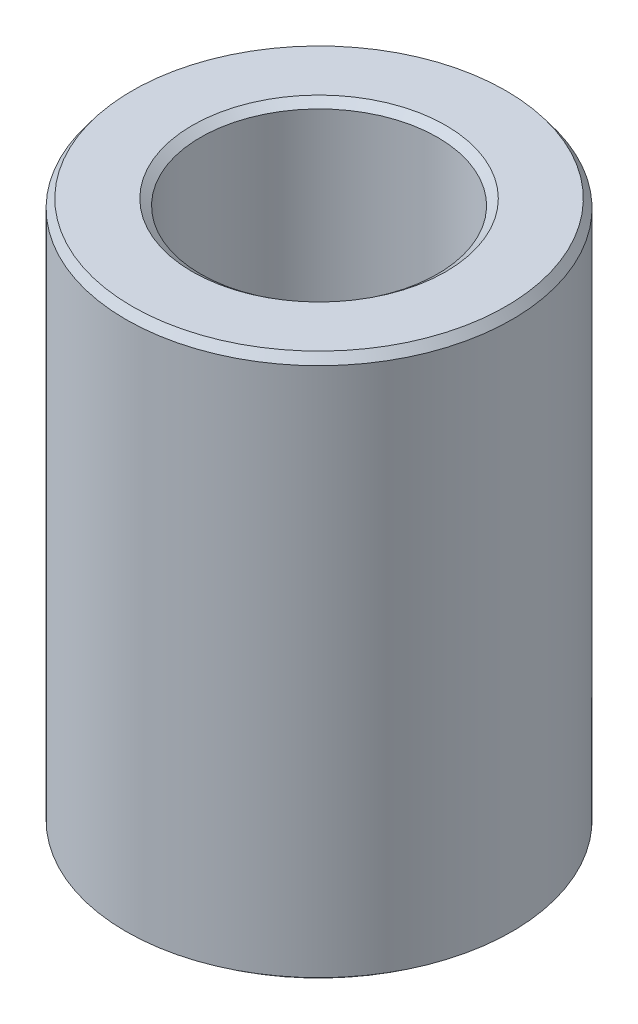
ISO-10303-21;
HEADER;
FILE_DESCRIPTION(('STEP AP214'),'2;1');
FILE_NAME('part.step','',(''),(''),'','','');
FILE_SCHEMA(('AUTOMOTIVE_DESIGN { 1 0 10303 214 1 1 1 1 }'));
ENDSEC;
DATA;
#1=APPLICATION_CONTEXT('core data for automotive mechanical design processes');
#2=APPLICATION_PROTOCOL_DEFINITION('international standard','automotive_design',2000,#1);
#3=PRODUCT_CONTEXT('',#1,'mechanical');
#4=PRODUCT('Part','Part','',(#3));
#5=PRODUCT_RELATED_PRODUCT_CATEGORY('part','',(#4));
#6=PRODUCT_DEFINITION_FORMATION('','',#4);
#7=PRODUCT_DEFINITION_CONTEXT('part definition',#1,'design');
#8=PRODUCT_DEFINITION('design','',#6,#7);
#9=PRODUCT_DEFINITION_SHAPE('','',#8);
#10=(LENGTH_UNIT() NAMED_UNIT(*) SI_UNIT(.MILLI.,.METRE.));
#11=(NAMED_UNIT(*) PLANE_ANGLE_UNIT() SI_UNIT($,.RADIAN.));
#12=(NAMED_UNIT(*) SI_UNIT($,.STERADIAN.) SOLID_ANGLE_UNIT());
#13=UNCERTAINTY_MEASURE_WITH_UNIT(LENGTH_MEASURE(1.E-05),#10,'distance_accuracy_value','');
#14=(GEOMETRIC_REPRESENTATION_CONTEXT(3) GLOBAL_UNCERTAINTY_ASSIGNED_CONTEXT((#13)) GLOBAL_UNIT_ASSIGNED_CONTEXT((#10,
#11,#12)) REPRESENTATION_CONTEXT('',''));
#15=CARTESIAN_POINT('',(0.,0.,0.));
#16=DIRECTION('',(0.,0.,1.));
#17=DIRECTION('',(1.,0.,0.));
#18=AXIS2_PLACEMENT_3D('',#15,#16,#17);
#19=CARTESIAN_POINT('',(0.,56.4109215033235,0.));
#20=DIRECTION('',(0.,-1.,0.));
#21=DIRECTION('',(0.,0.,-1.));
#22=AXIS2_PLACEMENT_3D('',#19,#20,#21);
#23=CYLINDRICAL_SURFACE('',#22,20.);
#24=CARTESIAN_POINT('',(0.,0.638685781611595,0.));
#25=DIRECTION('',(0.,1.,0.));
#26=DIRECTION('',(0.,0.,1.));
#27=AXIS2_PLACEMENT_3D('',#24,#25,#26);
#28=CIRCLE('',#27,20.);
#29=CARTESIAN_POINT('',(0.,0.638685781611595,20.));
#30=VERTEX_POINT('',#29);
#31=EDGE_CURVE('E10',#30,#30,#28,.T.);
#32=ORIENTED_EDGE('',*,*,#31,.T.);
#33=EDGE_LOOP('',(#32));
#34=FACE_BOUND('',#33,.T.);
#35=CARTESIAN_POINT('',(0.,55.5521593152775,0.));
#36=DIRECTION('',(0.,1.,0.));
#37=DIRECTION('',(0.,0.,1.));
#38=AXIS2_PLACEMENT_3D('',#35,#36,#37);
#39=CIRCLE('',#38,20.);
#40=CARTESIAN_POINT('',(0.,55.5521593152775,20.));
#41=VERTEX_POINT('',#40);
#42=EDGE_CURVE('E50',#41,#41,#39,.F.);
#43=ORIENTED_EDGE('',*,*,#42,.T.);
#44=EDGE_LOOP('',(#43));
#45=FACE_BOUND('',#44,.T.);
#46=ADVANCED_FACE('F39',(#34,#45),#23,.T.);
#47=CARTESIAN_POINT('',(0.,56.4109215033235,0.));
#48=DIRECTION('',(0.,1.,0.));
#49=DIRECTION('',(0.,0.,1.));
#50=AXIS2_PLACEMENT_3D('',#47,#48,#49);
#51=PLANE('',#50);
#52=CARTESIAN_POINT('',(0.,56.4109215033235,0.));
#53=DIRECTION('',(0.,1.,0.));
#54=DIRECTION('',(0.,0.,1.));
#55=AXIS2_PLACEMENT_3D('',#52,#53,#54);
#56=CIRCLE('',#55,13.1344381581055);
#57=CARTESIAN_POINT('',(0.,56.4109215033235,13.1344381581055));
#58=VERTEX_POINT('',#57);
#59=EDGE_CURVE('E58',#58,#58,#56,.F.);
#60=ORIENTED_EDGE('',*,*,#59,.T.);
#61=EDGE_LOOP('',(#60));
#62=FACE_BOUND('',#61,.T.);
#63=CARTESIAN_POINT('',(0.,56.4109215033235,0.));
#64=DIRECTION('',(0.,1.,0.));
#65=DIRECTION('',(0.,0.,1.));
#66=AXIS2_PLACEMENT_3D('',#63,#64,#65);
#67=CIRCLE('',#66,19.3613142183884);
#68=CARTESIAN_POINT('',(0.,56.4109215033235,19.3613142183884));
#69=VERTEX_POINT('',#68);
#70=EDGE_CURVE('E61',#69,#69,#67,.T.);
#71=ORIENTED_EDGE('',*,*,#70,.T.);
#72=EDGE_LOOP('',(#71));
#73=FACE_BOUND('',#72,.T.);
#74=ADVANCED_FACE('F88',(#62,#73),#51,.T.);
#75=CARTESIAN_POINT('',(0.,0.,0.));
#76=DIRECTION('',(0.,1.,0.));
#77=DIRECTION('',(0.,0.,1.));
#78=AXIS2_PLACEMENT_3D('',#75,#76,#77);
#79=PLANE('',#78);
#80=CARTESIAN_POINT('',(0.,0.,0.));
#81=DIRECTION('',(0.,1.,0.));
#82=DIRECTION('',(0.,0.,1.));
#83=AXIS2_PLACEMENT_3D('',#80,#81,#82);
#84=CIRCLE('',#83,12.9143617516711);
#85=CARTESIAN_POINT('',(0.,0.,-12.9143617516711));
#86=VERTEX_POINT('',#85);
#87=EDGE_CURVE('E51',#86,#86,#84,.T.);
#88=ORIENTED_EDGE('',*,*,#87,.T.);
#89=EDGE_LOOP('',(#88));
#90=FACE_BOUND('',#89,.T.);
#91=CARTESIAN_POINT('',(0.,0.,0.));
#92=DIRECTION('',(0.,1.,0.));
#93=DIRECTION('',(0.,0.,1.));
#94=AXIS2_PLACEMENT_3D('',#91,#92,#93);
#95=CIRCLE('',#94,19.141237811954);
#96=CARTESIAN_POINT('',(0.,0.,19.141237811954));
#97=VERTEX_POINT('',#96);
#98=EDGE_CURVE('E54',#97,#97,#95,.F.);
#99=ORIENTED_EDGE('',*,*,#98,.T.);
#100=EDGE_LOOP('',(#99));
#101=FACE_BOUND('',#100,.T.);
#102=ADVANCED_FACE('F83',(#90,#101),#79,.F.);
#103=CARTESIAN_POINT('',(0.,56.4109215033235,0.));
#104=DIRECTION('',(0.,-1.,0.));
#105=DIRECTION('',(0.,0.,-1.));
#106=AXIS2_PLACEMENT_3D('',#103,#104,#105);
#107=CYLINDRICAL_SURFACE('',#106,12.2756759700595);
#108=CARTESIAN_POINT('',(0.,55.7722357217118,0.));
#109=DIRECTION('',(0.,1.,0.));
#110=DIRECTION('',(0.,0.,1.));
#111=AXIS2_PLACEMENT_3D('',#108,#109,#110);
#112=CIRCLE('',#111,12.2756759700595);
#113=CARTESIAN_POINT('',(0.,55.7722357217118,-12.2756759700595));
#114=VERTEX_POINT('',#113);
#115=EDGE_CURVE('E67',#114,#114,#112,.T.);
#116=CARTESIAN_POINT('',(0.,0.858762188046008,0.));
#117=DIRECTION('',(0.,1.,0.));
#118=DIRECTION('',(0.,0.,1.));
#119=AXIS2_PLACEMENT_3D('',#116,#117,#118);
#120=CIRCLE('',#119,12.2756759700595);
#121=CARTESIAN_POINT('',(0.,0.858762188046008,-12.2756759700595));
#122=VERTEX_POINT('',#121);
#123=EDGE_CURVE('E69',#122,#122,#120,.F.);
#124=CARTESIAN_POINT('',(0.,55.7722357217118,-12.2756759700595));
#125=CARTESIAN_POINT('',(0.,55.2002203724028,-12.2756759700595));
#126=CARTESIAN_POINT('',(0.,54.6282050230938,-12.2756759700595));
#127=CARTESIAN_POINT('',(0.,53.4841743244758,-12.2756759700595));
#128=CARTESIAN_POINT('',(0.,52.9121589751667,-12.2756759700595));
#129=CARTESIAN_POINT('',(0.,51.7681282765487,-12.2756759700595));
#130=CARTESIAN_POINT('',(0.,51.1961129272397,-12.2756759700595));
#131=CARTESIAN_POINT('',(0.,50.0520822286217,-12.2756759700595));
#132=CARTESIAN_POINT('',(0.,49.4800668793126,-12.2756759700595));
#133=CARTESIAN_POINT('',(0.,48.3360361806946,-12.2756759700595));
#134=CARTESIAN_POINT('',(0.,47.7640208313856,-12.2756759700595));
#135=CARTESIAN_POINT('',(0.,46.6199901327675,-12.2756759700595));
#136=CARTESIAN_POINT('',(0.,46.0479747834585,-12.2756759700595));
#137=CARTESIAN_POINT('',(0.,44.9039440848405,-12.2756759700595));
#138=CARTESIAN_POINT('',(0.,44.3319287355315,-12.2756759700595));
#139=CARTESIAN_POINT('',(0.,43.1878980369134,-12.2756759700595));
#140=CARTESIAN_POINT('',(0.,42.6158826876044,-12.2756759700595));
#141=CARTESIAN_POINT('',(0.,41.4718519889864,-12.2756759700595));
#142=CARTESIAN_POINT('',(0.,40.8998366396773,-12.2756759700595));
#143=CARTESIAN_POINT('',(0.,39.7558059410593,-12.2756759700595));
#144=CARTESIAN_POINT('',(0.,39.1837905917503,-12.2756759700595));
#145=CARTESIAN_POINT('',(0.,38.0397598931322,-12.2756759700595));
#146=CARTESIAN_POINT('',(0.,37.4677445438232,-12.2756759700595));
#147=CARTESIAN_POINT('',(0.,36.3237138452052,-12.2756759700595));
#148=CARTESIAN_POINT('',(0.,35.7516984958962,-12.2756759700595));
#149=CARTESIAN_POINT('',(0.,34.6076677972781,-12.2756759700595));
#150=CARTESIAN_POINT('',(0.,34.0356524479691,-12.2756759700595));
#151=CARTESIAN_POINT('',(0.,32.8916217493511,-12.2756759700595));
#152=CARTESIAN_POINT('',(0.,32.3196064000421,-12.2756759700595));
#153=CARTESIAN_POINT('',(0.,31.175575701424,-12.2756759700595));
#154=CARTESIAN_POINT('',(0.,30.603560352115,-12.2756759700595));
#155=CARTESIAN_POINT('',(0.,29.459529653497,-12.2756759700595));
#156=CARTESIAN_POINT('',(0.,28.8875143041879,-12.2756759700595));
#157=CARTESIAN_POINT('',(0.,27.7434836055699,-12.2756759700595));
#158=CARTESIAN_POINT('',(0.,27.1714682562609,-12.2756759700595));
#159=CARTESIAN_POINT('',(0.,26.0274375576428,-12.2756759700595));
#160=CARTESIAN_POINT('',(0.,25.4554222083338,-12.2756759700595));
#161=CARTESIAN_POINT('',(0.,24.3113915097158,-12.2756759700595));
#162=CARTESIAN_POINT('',(0.,23.7393761604068,-12.2756759700595));
#163=CARTESIAN_POINT('',(0.,22.5953454617887,-12.2756759700595));
#164=CARTESIAN_POINT('',(0.,22.0233301124797,-12.2756759700595));
#165=CARTESIAN_POINT('',(0.,20.8792994138617,-12.2756759700595));
#166=CARTESIAN_POINT('',(0.,20.3072840645527,-12.2756759700595));
#167=CARTESIAN_POINT('',(0.,19.1632533659346,-12.2756759700595));
#168=CARTESIAN_POINT('',(0.,18.5912380166256,-12.2756759700595));
#169=CARTESIAN_POINT('',(0.,17.4472073180076,-12.2756759700595));
#170=CARTESIAN_POINT('',(0.,16.8751919686985,-12.2756759700595));
#171=CARTESIAN_POINT('',(0.,15.7311612700805,-12.2756759700595));
#172=CARTESIAN_POINT('',(0.,15.1591459207715,-12.2756759700595));
#173=CARTESIAN_POINT('',(0.,14.0151152221534,-12.2756759700595));
#174=CARTESIAN_POINT('',(0.,13.4430998728444,-12.2756759700595));
#175=CARTESIAN_POINT('',(0.,12.2990691742264,-12.2756759700595));
#176=CARTESIAN_POINT('',(0.,11.7270538249174,-12.2756759700595));
#177=CARTESIAN_POINT('',(0.,10.5830231262993,-12.2756759700595));
#178=CARTESIAN_POINT('',(0.,10.0110077769903,-12.2756759700595));
#179=CARTESIAN_POINT('',(0.,8.86697707837228,-12.2756759700595));
#180=CARTESIAN_POINT('',(0.,8.29496172906326,-12.2756759700595));
#181=CARTESIAN_POINT('',(0.,7.15093103044522,-12.2756759700595));
#182=CARTESIAN_POINT('',(0.,6.5789156811362,-12.2756759700595));
#183=CARTESIAN_POINT('',(0.,5.43488498251816,-12.2756759700595));
#184=CARTESIAN_POINT('',(0.,4.86286963320914,-12.2756759700595));
#185=CARTESIAN_POINT('',(0.,3.71883893459111,-12.2756759700595));
#186=CARTESIAN_POINT('',(0.,3.14682358528209,-12.2756759700595));
#187=CARTESIAN_POINT('',(0.,2.00279288666405,-12.2756759700595));
#188=CARTESIAN_POINT('',(0.,1.43077753735503,-12.2756759700595));
#189=CARTESIAN_POINT('',(0.,0.858762188046008,-12.2756759700595));
#190=B_SPLINE_CURVE_WITH_KNOTS('',3,(#124,#125,#126,#127,#128,#129,#130,#131,#132,#133,#134,
#135,#136,#137,#138,#139,#140,#141,#142,#143,#144,#145,#146,#147,#148,#149,#150,#151,#152,#153,
#154,#155,#156,#157,#158,#159,#160,#161,#162,#163,#164,#165,#166,#167,#168,#169,#170,#171,#172,
#173,#174,#175,#176,#177,#178,#179,#180,#181,#182,#183,#184,#185,#186,#187,#188,#189),
.UNSPECIFIED.,.F.,.F.,(4,2,2,2,2,2,2,2,2,2,2,2,2,2,2,2,2,2,2,2,2,2,2,2,2,2,2,2,2,2,2,2,4),(0.,
1.71604604792705,3.43209209585411,5.14813814378116,6.86418419170823,8.58023023963528,
10.2962762875623,12.0123223354894,13.7283683834165,15.4444144313435,17.1604604792706,
18.8765065271976,20.5925525751247,22.3085986230517,24.0246446709788,25.7406907189059,
27.4567367668329,29.17278281476,30.888828862687,32.6048749106141,34.3209209585411,
36.0369670064682,37.7530130543953,39.4690591023223,41.1851051502494,42.9011511981764,
44.6171972461035,46.3332432940305,48.0492893419576,49.7653353898846,51.4813814378117,
53.1974274857388,54.9134735336658),.UNSPECIFIED.);
#191=EDGE_CURVE('BSEAM71',#114,#122,#190,.T.);
#192=ORIENTED_EDGE('',*,*,#115,.T.);
#193=ORIENTED_EDGE('',*,*,#123,.T.);
#194=ORIENTED_EDGE('',*,*,#191,.T.);
#195=ORIENTED_EDGE('',*,*,#191,.F.);
#196=EDGE_LOOP('',(#192,#194,#193,#195));
#197=FACE_BOUND('',#196,.T.);
#198=ADVANCED_FACE('F71',(#197),#107,.F.);
#199=CARTESIAN_POINT('',(0.,55.7722357217118,0.));
#200=DIRECTION('',(0.,1.,0.));
#201=DIRECTION('',(0.,0.,1.));
#202=AXIS2_PLACEMENT_3D('',#199,#200,#201);
#203=CONICAL_SURFACE('',#202,12.2756759700595,0.931321174674212);
#204=ORIENTED_EDGE('',*,*,#59,.F.);
#205=EDGE_LOOP('',(#204));
#206=FACE_BOUND('',#205,.T.);
#207=ORIENTED_EDGE('',*,*,#115,.F.);
#208=EDGE_LOOP('',(#207));
#209=FACE_BOUND('',#208,.T.);
#210=ADVANCED_FACE('F77',(#206,#209),#203,.F.);
#211=CARTESIAN_POINT('',(0.,0.,0.));
#212=DIRECTION('',(0.,-1.,0.));
#213=DIRECTION('',(0.,0.,-1.));
#214=AXIS2_PLACEMENT_3D('',#211,#212,#213);
#215=CONICAL_SURFACE('',#214,12.9143617516711,0.63947515212068);
#216=CARTESIAN_POINT('',(0.,0.858762188046008,-12.2756759700595));
#217=CARTESIAN_POINT('',(0.,0.849816748587195,-12.2823289469513));
#218=CARTESIAN_POINT('',(0.,0.840871309128383,-12.288981923843));
#219=CARTESIAN_POINT('',(0.,0.822980430210758,-12.3022878776266));
#220=CARTESIAN_POINT('',(0.,0.814034990751946,-12.3089408545184));
#221=CARTESIAN_POINT('',(0.,0.79614411183432,-12.322246808302));
#222=CARTESIAN_POINT('',(0.,0.787198672375507,-12.3288997851938));
#223=CARTESIAN_POINT('',(0.,0.769307793457882,-12.3422057389773));
#224=CARTESIAN_POINT('',(0.,0.76036235399907,-12.3488587158691));
#225=CARTESIAN_POINT('',(0.,0.742471475081445,-12.3621646696527));
#226=CARTESIAN_POINT('',(0.,0.733526035622632,-12.3688176465445));
#227=CARTESIAN_POINT('',(0.,0.715635156705007,-12.3821236003281));
#228=CARTESIAN_POINT('',(0.,0.706689717246194,-12.3887765772199));
#229=CARTESIAN_POINT('',(0.,0.688798838328569,-12.4020825310034));
#230=CARTESIAN_POINT('',(0.,0.679853398869756,-12.4087355078952));
#231=CARTESIAN_POINT('',(0.,0.661962519952131,-12.4220414616788));
#232=CARTESIAN_POINT('',(0.,0.653017080493319,-12.4286944385706));
#233=CARTESIAN_POINT('',(0.,0.635126201575694,-12.4420003923542));
#234=CARTESIAN_POINT('',(0.,0.626180762116881,-12.4486533692459));
#235=CARTESIAN_POINT('',(0.,0.608289883199256,-12.4619593230295));
#236=CARTESIAN_POINT('',(0.,0.599344443740443,-12.4686122999213));
#237=CARTESIAN_POINT('',(0.,0.581453564822818,-12.4819182537049));
#238=CARTESIAN_POINT('',(0.,0.572508125364005,-12.4885712305967));
#239=CARTESIAN_POINT('',(0.,0.55461724644638,-12.5018771843803));
#240=CARTESIAN_POINT('',(0.,0.545671806987568,-12.508530161272));
#241=CARTESIAN_POINT('',(0.,0.527780928069943,-12.5218361150556));
#242=CARTESIAN_POINT('',(0.,0.51883548861113,-12.5284890919474));
#243=CARTESIAN_POINT('',(0.,0.500944609693505,-12.541795045731));
#244=CARTESIAN_POINT('',(0.,0.491999170234692,-12.5484480226228));
#245=CARTESIAN_POINT('',(0.,0.474108291317067,-12.5617539764063));
#246=CARTESIAN_POINT('',(0.,0.465162851858255,-12.5684069532981));
#247=CARTESIAN_POINT('',(0.,0.447271972940629,-12.5817129070817));
#248=CARTESIAN_POINT('',(0.,0.438326533481816,-12.5883658839735));
#249=CARTESIAN_POINT('',(0.,0.420435654564191,-12.6016718377571));
#250=CARTESIAN_POINT('',(0.,0.411490215105379,-12.6083248146489));
#251=CARTESIAN_POINT('',(0.,0.393599336187754,-12.6216307684324));
#252=CARTESIAN_POINT('',(0.,0.384653896728941,-12.6282837453242));
#253=CARTESIAN_POINT('',(0.,0.366763017811316,-12.6415896991078));
#254=CARTESIAN_POINT('',(0.,0.357817578352504,-12.6482426759996));
#255=CARTESIAN_POINT('',(0.,0.339926699434878,-12.6615486297832));
#256=CARTESIAN_POINT('',(0.,0.330981259976066,-12.6682016066749));
#257=CARTESIAN_POINT('',(0.,0.31309038105844,-12.6815075604585));
#258=CARTESIAN_POINT('',(0.,0.304144941599628,-12.6881605373503));
#259=CARTESIAN_POINT('',(0.,0.286254062682003,-12.7014664911339));
#260=CARTESIAN_POINT('',(0.,0.27730862322319,-12.7081194680257));
#261=CARTESIAN_POINT('',(0.,0.259417744305565,-12.7214254218092));
#262=CARTESIAN_POINT('',(0.,0.250472304846753,-12.728078398701));
#263=CARTESIAN_POINT('',(0.,0.232581425929127,-12.7413843524846));
#264=CARTESIAN_POINT('',(0.,0.223635986470314,-12.7480373293764));
#265=CARTESIAN_POINT('',(0.,0.205745107552689,-12.76134328316));
#266=CARTESIAN_POINT('',(0.,0.196799668093877,-12.7679962600518));
#267=CARTESIAN_POINT('',(0.,0.178908789176252,-12.7813022138353));
#268=CARTESIAN_POINT('',(0.,0.169963349717439,-12.7879551907271));
#269=CARTESIAN_POINT('',(0.,0.152072470799814,-12.8012611445107));
#270=CARTESIAN_POINT('',(0.,0.143127031341001,-12.8079141214025));
#271=CARTESIAN_POINT('',(0.,0.125236152423376,-12.8212200751861));
#272=CARTESIAN_POINT('',(0.,0.116290712964563,-12.8278730520778));
#273=CARTESIAN_POINT('',(0.,0.0983998340469383,-12.8411790058614));
#274=CARTESIAN_POINT('',(0.,0.089454394588126,-12.8478319827532));
#275=CARTESIAN_POINT('',(0.,0.0715635156705008,-12.8611379365368));
#276=CARTESIAN_POINT('',(0.,0.062618076211688,-12.8677909134286));
#277=CARTESIAN_POINT('',(0.,0.0447271972940627,-12.8810968672121));
#278=CARTESIAN_POINT('',(0.,0.0357817578352503,-12.8877498441039));
#279=CARTESIAN_POINT('',(0.,0.0178908789176255,-12.9010557978875));
#280=CARTESIAN_POINT('',(0.,0.00894543945881307,-12.9077087747793));
#281=CARTESIAN_POINT('',(0.,0.,-12.9143617516711));
#282=B_SPLINE_CURVE_WITH_KNOTS('',3,(#216,#217,#218,#219,#220,#221,#222,#223,#224,#225,#226,
#227,#228,#229,#230,#231,#232,#233,#234,#235,#236,#237,#238,#239,#240,#241,#242,#243,#244,#245,
#246,#247,#248,#249,#250,#251,#252,#253,#254,#255,#256,#257,#258,#259,#260,#261,#262,#263,#264,
#265,#266,#267,#268,#269,#270,#271,#272,#273,#274,#275,#276,#277,#278,#279,#280,#281),
.UNSPECIFIED.,.F.,.F.,(4,2,2,2,2,2,2,2,2,2,2,2,2,2,2,2,2,2,2,2,2,2,2,2,2,2,2,2,2,2,2,2,4),(0.,
0.033444684147192,0.066889368294385,0.100334052441577,0.13377873658877,0.167223420735962,
0.200668104883155,0.234112789030347,0.26755747317754,0.301002157324732,0.334446841471925,
0.367891525619117,0.40133620976631,0.434780893913502,0.468225578060695,0.501670262207887,
0.535114946355079,0.568559630502272,0.602004314649464,0.635448998796657,0.668893682943849,
0.702338367091042,0.735783051238234,0.769227735385427,0.802672419532619,0.836117103679812,
0.869561787827004,0.903006471974197,0.936451156121389,0.969895840268582,1.00334052441577,
1.03678520856297,1.07022989271016),.UNSPECIFIED.);
#283=EDGE_CURVE('BSEAM73',#122,#86,#282,.T.);
#284=ORIENTED_EDGE('',*,*,#123,.F.);
#285=ORIENTED_EDGE('',*,*,#87,.F.);
#286=ORIENTED_EDGE('',*,*,#283,.T.);
#287=ORIENTED_EDGE('',*,*,#283,.F.);
#288=EDGE_LOOP('',(#284,#286,#285,#287));
#289=FACE_BOUND('',#288,.T.);
#290=ADVANCED_FACE('F73',(#289),#215,.F.);
#291=CARTESIAN_POINT('',(0.,0.638685781611595,0.));
#292=DIRECTION('',(0.,1.,0.));
#293=DIRECTION('',(0.,0.,1.));
#294=AXIS2_PLACEMENT_3D('',#291,#292,#293);
#295=CONICAL_SURFACE('',#294,20.,0.93132117467422);
#296=ORIENTED_EDGE('',*,*,#98,.F.);
#297=EDGE_LOOP('',(#296));
#298=FACE_BOUND('',#297,.T.);
#299=ORIENTED_EDGE('',*,*,#31,.F.);
#300=EDGE_LOOP('',(#299));
#301=FACE_BOUND('',#300,.T.);
#302=ADVANCED_FACE('F76',(#298,#301),#295,.T.);
#303=CARTESIAN_POINT('',(0.,56.4109215033235,0.));
#304=DIRECTION('',(0.,-1.,0.));
#305=DIRECTION('',(0.,0.,-1.));
#306=AXIS2_PLACEMENT_3D('',#303,#304,#305);
#307=CONICAL_SURFACE('',#306,19.3613142183884,0.639475152120681);
#308=ORIENTED_EDGE('',*,*,#42,.F.);
#309=EDGE_LOOP('',(#308));
#310=FACE_BOUND('',#309,.T.);
#311=ORIENTED_EDGE('',*,*,#70,.F.);
#312=EDGE_LOOP('',(#311));
#313=FACE_BOUND('',#312,.T.);
#314=ADVANCED_FACE('F45',(#310,#313),#307,.T.);
#315=CLOSED_SHELL('',(#46,#74,#102,#198,#210,#290,#302,#314));
#316=MANIFOLD_SOLID_BREP('B2',#315);
#317=ADVANCED_BREP_SHAPE_REPRESENTATION('',(#18,#316),#14);
#318=SHAPE_DEFINITION_REPRESENTATION(#9,#317);
ENDSEC;
END-ISO-10303-21;
